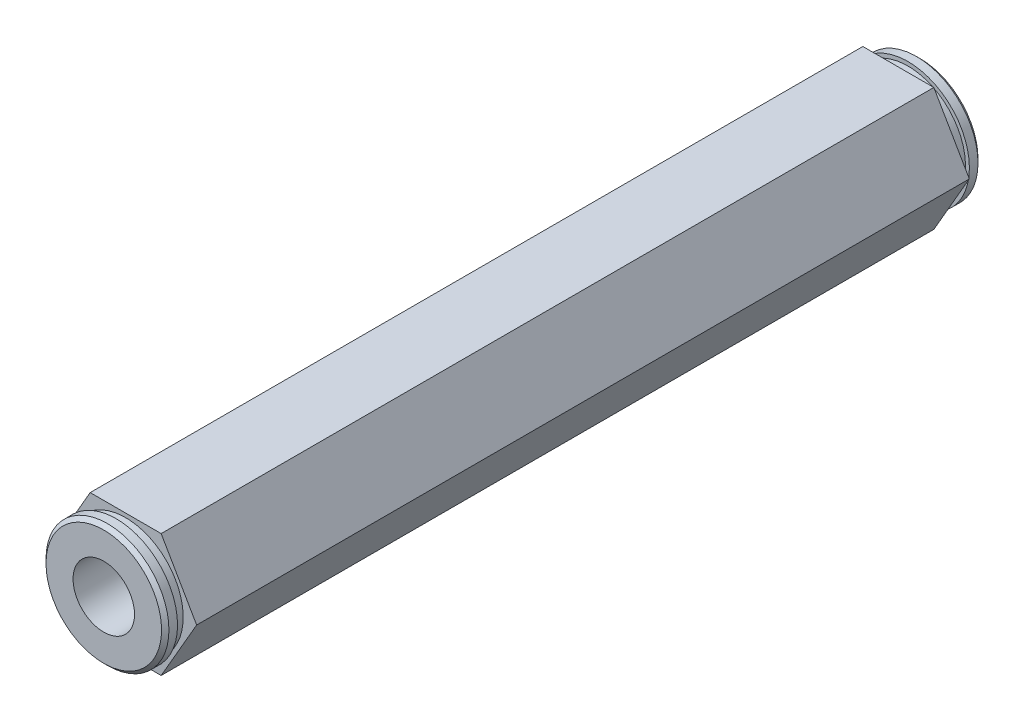
ISO-10303-21;
HEADER;
FILE_DESCRIPTION(('STEP AP214'),'2;1');
FILE_NAME('part.step','',(''),(''),'','','');
FILE_SCHEMA(('AUTOMOTIVE_DESIGN { 1 0 10303 214 1 1 1 1 }'));
ENDSEC;
DATA;
#1=APPLICATION_CONTEXT('core data for automotive mechanical design processes');
#2=APPLICATION_PROTOCOL_DEFINITION('international standard','automotive_design',2000,#1);
#3=PRODUCT_CONTEXT('',#1,'mechanical');
#4=PRODUCT('Part','Part','',(#3));
#5=PRODUCT_RELATED_PRODUCT_CATEGORY('part','',(#4));
#6=PRODUCT_DEFINITION_FORMATION('','',#4);
#7=PRODUCT_DEFINITION_CONTEXT('part definition',#1,'design');
#8=PRODUCT_DEFINITION('design','',#6,#7);
#9=PRODUCT_DEFINITION_SHAPE('','',#8);
#10=(LENGTH_UNIT() NAMED_UNIT(*) SI_UNIT(.MILLI.,.METRE.));
#11=(NAMED_UNIT(*) PLANE_ANGLE_UNIT() SI_UNIT($,.RADIAN.));
#12=(NAMED_UNIT(*) SI_UNIT($,.STERADIAN.) SOLID_ANGLE_UNIT());
#13=UNCERTAINTY_MEASURE_WITH_UNIT(LENGTH_MEASURE(1.E-05),#10,'distance_accuracy_value','');
#14=(GEOMETRIC_REPRESENTATION_CONTEXT(3) GLOBAL_UNCERTAINTY_ASSIGNED_CONTEXT((#13)) GLOBAL_UNIT_ASSIGNED_CONTEXT((#10,
#11,#12)) REPRESENTATION_CONTEXT('',''));
#15=CARTESIAN_POINT('',(0.,0.,0.));
#16=DIRECTION('',(0.,0.,1.));
#17=DIRECTION('',(1.,0.,0.));
#18=AXIS2_PLACEMENT_3D('',#15,#16,#17);
#19=CARTESIAN_POINT('',(0.,0.,37.5157999999942));
#20=DIRECTION('',(0.,0.,1.));
#21=DIRECTION('',(1.,0.,0.));
#22=AXIS2_PLACEMENT_3D('',#19,#20,#21);
#23=CONICAL_SURFACE('',#22,2.98450000002504,1.0297442586837);
#24=CARTESIAN_POINT('',(0.,0.,35.72253148252));
#25=VERTEX_POINT('',#24);
#26=VERTEX_LOOP('',#25);
#27=FACE_BOUND('',#26,.T.);
#28=CARTESIAN_POINT('',(0.,0.,37.5158));
#29=DIRECTION('',(0.,0.,1.));
#30=DIRECTION('',(1.,0.,0.));
#31=AXIS2_PLACEMENT_3D('',#28,#29,#30);
#32=CIRCLE('',#31,2.9845);
#33=CARTESIAN_POINT('',(2.9845,0.,37.5158));
#34=VERTEX_POINT('',#33);
#35=EDGE_CURVE('E78',#34,#34,#32,.T.);
#36=ORIENTED_EDGE('',*,*,#35,.T.);
#37=EDGE_LOOP('',(#36));
#38=FACE_BOUND('',#37,.T.);
#39=ADVANCED_FACE('F17',(#27,#38),#23,.F.);
#40=CARTESIAN_POINT('',(0.,0.,42.2783));
#41=DIRECTION('',(0.,0.,1.));
#42=DIRECTION('',(1.,0.,0.));
#43=AXIS2_PLACEMENT_3D('',#40,#41,#42);
#44=CYLINDRICAL_SURFACE('',#43,2.9845);
#45=ORIENTED_EDGE('',*,*,#35,.F.);
#46=EDGE_LOOP('',(#45));
#47=FACE_BOUND('',#46,.T.);
#48=CARTESIAN_POINT('',(0.,0.,39.1033));
#49=DIRECTION('',(0.,0.,1.));
#50=DIRECTION('',(1.,0.,0.));
#51=AXIS2_PLACEMENT_3D('',#48,#49,#50);
#52=CIRCLE('',#51,2.9845);
#53=CARTESIAN_POINT('',(2.9845,0.,39.1033));
#54=VERTEX_POINT('',#53);
#55=EDGE_CURVE('E20',#54,#54,#52,.F.);
#56=ORIENTED_EDGE('',*,*,#55,.F.);
#57=EDGE_LOOP('',(#56));
#58=FACE_BOUND('',#57,.T.);
#59=ADVANCED_FACE('F75',(#47,#58),#44,.F.);
#60=CARTESIAN_POINT('',(0.,0.,39.1033));
#61=DIRECTION('',(0.,0.,1.));
#62=DIRECTION('',(1.,0.,0.));
#63=AXIS2_PLACEMENT_3D('',#60,#61,#62);
#64=PLANE('',#63);
#65=CARTESIAN_POINT('',(0.,0.,39.1033));
#66=DIRECTION('',(0.,0.,1.));
#67=DIRECTION('',(1.,0.,0.));
#68=AXIS2_PLACEMENT_3D('',#65,#66,#67);
#69=CIRCLE('',#68,3.175);
#70=CARTESIAN_POINT('',(3.175,0.,39.1033));
#71=VERTEX_POINT('',#70);
#72=EDGE_CURVE('E82',#71,#71,#69,.T.);
#73=ORIENTED_EDGE('',*,*,#72,.T.);
#74=EDGE_LOOP('',(#73));
#75=FACE_BOUND('',#74,.T.);
#76=ORIENTED_EDGE('',*,*,#55,.T.);
#77=EDGE_LOOP('',(#76));
#78=FACE_BOUND('',#77,.T.);
#79=ADVANCED_FACE('F125',(#75,#78),#64,.T.);
#80=CARTESIAN_POINT('',(0.,0.,43.07205));
#81=DIRECTION('',(0.,0.,1.));
#82=DIRECTION('',(1.,0.,0.));
#83=AXIS2_PLACEMENT_3D('',#80,#81,#82);
#84=CYLINDRICAL_SURFACE('',#83,3.175);
#85=ORIENTED_EDGE('',*,*,#72,.F.);
#86=EDGE_LOOP('',(#85));
#87=FACE_BOUND('',#86,.T.);
#88=CARTESIAN_POINT('',(0.,0.,47.0408));
#89=DIRECTION('',(0.,0.,1.));
#90=DIRECTION('',(1.,0.,0.));
#91=AXIS2_PLACEMENT_3D('',#88,#89,#90);
#92=CIRCLE('',#91,3.175);
#93=CARTESIAN_POINT('',(3.175,0.,47.0408));
#94=VERTEX_POINT('',#93);
#95=EDGE_CURVE('E120',#94,#94,#92,.T.);
#96=ORIENTED_EDGE('',*,*,#95,.T.);
#97=EDGE_LOOP('',(#96));
#98=FACE_BOUND('',#97,.T.);
#99=ADVANCED_FACE('F128',(#87,#98),#84,.F.);
#100=CARTESIAN_POINT('',(0.,0.,-37.2999));
#101=DIRECTION('',(0.,0.,1.));
#102=DIRECTION('',(1.,0.,0.));
#103=AXIS2_PLACEMENT_3D('',#100,#101,#102);
#104=PLANE('',#103);
#105=CARTESIAN_POINT('',(0.,0.,-37.2999000000505));
#106=DIRECTION('',(0.,0.,1.));
#107=DIRECTION('',(1.,0.,0.));
#108=AXIS2_PLACEMENT_3D('',#105,#106,#107);
#109=CIRCLE('',#108,5.96899999993639);
#110=CARTESIAN_POINT('',(5.96899999993639,0.,-37.2999000000505));
#111=VERTEX_POINT('',#110);
#112=EDGE_CURVE('E117',#111,#111,#109,.T.);
#113=ORIENTED_EDGE('',*,*,#112,.F.);
#114=EDGE_LOOP('',(#113));
#115=FACE_BOUND('',#114,.T.);
#116=ADVANCED_FACE('F131',(#115),#104,.F.);
#117=CARTESIAN_POINT('',(0.,0.,47.0408));
#118=DIRECTION('',(0.,0.,-1.));
#119=DIRECTION('',(-1.,0.,0.));
#120=AXIS2_PLACEMENT_3D('',#117,#118,#119);
#121=PLANE('',#120);
#122=CARTESIAN_POINT('',(0.,0.,47.0408000000475));
#123=DIRECTION('',(0.,0.,-1.));
#124=DIRECTION('',(-1.,0.,0.));
#125=AXIS2_PLACEMENT_3D('',#122,#123,#124);
#126=CIRCLE('',#125,5.96899999993639);
#127=CARTESIAN_POINT('',(-5.96899999993639,0.,47.0408000000475));
#128=VERTEX_POINT('',#127);
#129=EDGE_CURVE('E113',#128,#128,#126,.T.);
#130=ORIENTED_EDGE('',*,*,#129,.F.);
#131=EDGE_LOOP('',(#130));
#132=FACE_BOUND('',#131,.T.);
#133=ORIENTED_EDGE('',*,*,#95,.F.);
#134=EDGE_LOOP('',(#133));
#135=FACE_BOUND('',#134,.T.);
#136=ADVANCED_FACE('F135',(#132,#135),#121,.F.);
#137=CARTESIAN_POINT('',(0.,0.,-36.9189000000461));
#138=DIRECTION('',(0.,0.,1.));
#139=DIRECTION('',(1.,0.,0.));
#140=AXIS2_PLACEMENT_3D('',#137,#138,#139);
#141=CONICAL_SURFACE('',#140,6.34999999994079,0.785398163397448);
#142=ORIENTED_EDGE('',*,*,#112,.T.);
#143=EDGE_LOOP('',(#142));
#144=FACE_BOUND('',#143,.T.);
#145=CARTESIAN_POINT('',(0.,0.,-36.9189));
#146=DIRECTION('',(0.,0.,1.));
#147=DIRECTION('',(1.,0.,0.));
#148=AXIS2_PLACEMENT_3D('',#145,#146,#147);
#149=CIRCLE('',#148,6.35);
#150=CARTESIAN_POINT('',(6.35,0.,-36.9189));
#151=VERTEX_POINT('',#150);
#152=EDGE_CURVE('E116',#151,#151,#149,.T.);
#153=ORIENTED_EDGE('',*,*,#152,.F.);
#154=EDGE_LOOP('',(#153));
#155=FACE_BOUND('',#154,.T.);
#156=ADVANCED_FACE('F137',(#144,#155),#141,.T.);
#157=CARTESIAN_POINT('',(0.,0.,46.6598000000431));
#158=DIRECTION('',(0.,0.,-1.));
#159=DIRECTION('',(-1.,0.,0.));
#160=AXIS2_PLACEMENT_3D('',#157,#158,#159);
#161=CONICAL_SURFACE('',#160,6.34999999994079,0.785398163397448);
#162=CARTESIAN_POINT('',(0.,0.,46.6598));
#163=DIRECTION('',(0.,0.,1.));
#164=DIRECTION('',(1.,0.,0.));
#165=AXIS2_PLACEMENT_3D('',#162,#163,#164);
#166=CIRCLE('',#165,6.35);
#167=CARTESIAN_POINT('',(6.35,0.,46.6598));
#168=VERTEX_POINT('',#167);
#169=EDGE_CURVE('E112',#168,#168,#166,.F.);
#170=ORIENTED_EDGE('',*,*,#169,.F.);
#171=EDGE_LOOP('',(#170));
#172=FACE_BOUND('',#171,.T.);
#173=ORIENTED_EDGE('',*,*,#129,.T.);
#174=EDGE_LOOP('',(#173));
#175=FACE_BOUND('',#174,.T.);
#176=ADVANCED_FACE('F145',(#172,#175),#161,.T.);
#177=CARTESIAN_POINT('',(0.,0.,-37.2999));
#178=DIRECTION('',(0.,0.,1.));
#179=DIRECTION('',(1.,0.,0.));
#180=AXIS2_PLACEMENT_3D('',#177,#178,#179);
#181=CYLINDRICAL_SURFACE('',#180,6.35);
#182=ORIENTED_EDGE('',*,*,#152,.T.);
#183=EDGE_LOOP('',(#182));
#184=FACE_BOUND('',#183,.T.);
#185=CARTESIAN_POINT('',(0.,0.,-36.0299));
#186=DIRECTION('',(0.,0.,1.));
#187=DIRECTION('',(1.,0.,0.));
#188=AXIS2_PLACEMENT_3D('',#185,#186,#187);
#189=CIRCLE('',#188,6.35);
#190=CARTESIAN_POINT('',(6.35,0.,-36.0299));
#191=VERTEX_POINT('',#190);
#192=EDGE_CURVE('E109',#191,#191,#189,.F.);
#193=ORIENTED_EDGE('',*,*,#192,.T.);
#194=EDGE_LOOP('',(#193));
#195=FACE_BOUND('',#194,.T.);
#196=ADVANCED_FACE('F205',(#184,#195),#181,.T.);
#197=CARTESIAN_POINT('',(0.,0.,0.));
#198=DIRECTION('',(0.,0.,1.));
#199=DIRECTION('',(1.,0.,0.));
#200=AXIS2_PLACEMENT_3D('',#197,#198,#199);
#201=CYLINDRICAL_SURFACE('',#200,6.35);
#202=ORIENTED_EDGE('',*,*,#169,.T.);
#203=EDGE_LOOP('',(#202));
#204=FACE_BOUND('',#203,.T.);
#205=CARTESIAN_POINT('',(0.,0.,45.7708));
#206=DIRECTION('',(0.,0.,1.));
#207=DIRECTION('',(1.,0.,0.));
#208=AXIS2_PLACEMENT_3D('',#205,#206,#207);
#209=CIRCLE('',#208,6.35);
#210=CARTESIAN_POINT('',(6.35,0.,45.7708));
#211=VERTEX_POINT('',#210);
#212=EDGE_CURVE('E106',#211,#211,#209,.T.);
#213=ORIENTED_EDGE('',*,*,#212,.T.);
#214=EDGE_LOOP('',(#213));
#215=FACE_BOUND('',#214,.T.);
#216=ADVANCED_FACE('F201',(#204,#215),#201,.T.);
#217=CARTESIAN_POINT('',(0.,7.49836623834794,-36.0299));
#218=DIRECTION('',(0.,0.,-1.));
#219=DIRECTION('',(0.,1.,0.));
#220=AXIS2_PLACEMENT_3D('',#217,#218,#219);
#221=PLANE('',#220);
#222=CARTESIAN_POINT('',(0.,0.,-36.0299));
#223=DIRECTION('',(0.,0.,1.));
#224=DIRECTION('',(0.,-1.,0.));
#225=AXIS2_PLACEMENT_3D('',#222,#223,#224);
#226=CIRCLE('',#225,5.9436);
#227=CARTESIAN_POINT('',(0.,-5.94359999999998,-36.0299));
#228=VERTEX_POINT('',#227);
#229=EDGE_CURVE('E103',#228,#228,#226,.T.);
#230=ORIENTED_EDGE('',*,*,#229,.F.);
#231=EDGE_LOOP('',(#230));
#232=FACE_BOUND('',#231,.T.);
#233=ORIENTED_EDGE('',*,*,#192,.F.);
#234=EDGE_LOOP('',(#233));
#235=FACE_BOUND('',#234,.T.);
#236=ADVANCED_FACE('F197',(#232,#235),#221,.F.);
#237=CARTESIAN_POINT('',(0.,6.51362770001113,45.7708));
#238=DIRECTION('',(0.,0.,1.));
#239=DIRECTION('',(0.,-1.,0.));
#240=AXIS2_PLACEMENT_3D('',#237,#238,#239);
#241=PLANE('',#240);
#242=CARTESIAN_POINT('',(0.,0.,45.7708));
#243=DIRECTION('',(0.,0.,1.));
#244=DIRECTION('',(0.,-1.,0.));
#245=AXIS2_PLACEMENT_3D('',#242,#243,#244);
#246=CIRCLE('',#245,5.9436);
#247=CARTESIAN_POINT('',(0.,-5.9436,45.7708));
#248=VERTEX_POINT('',#247);
#249=EDGE_CURVE('E99',#248,#248,#246,.F.);
#250=ORIENTED_EDGE('',*,*,#249,.F.);
#251=EDGE_LOOP('',(#250));
#252=FACE_BOUND('',#251,.T.);
#253=ORIENTED_EDGE('',*,*,#212,.F.);
#254=EDGE_LOOP('',(#253));
#255=FACE_BOUND('',#254,.T.);
#256=ADVANCED_FACE('F193',(#252,#255),#241,.F.);
#257=CARTESIAN_POINT('',(0.,0.,-35.5346));
#258=DIRECTION('',(0.,0.,1.));
#259=DIRECTION('',(0.,-1.,0.));
#260=AXIS2_PLACEMENT_3D('',#257,#258,#259);
#261=CYLINDRICAL_SURFACE('',#260,5.9436);
#262=CARTESIAN_POINT('',(0.,0.,-35.0393));
#263=DIRECTION('',(0.,0.,1.));
#264=DIRECTION('',(0.,-1.,0.));
#265=AXIS2_PLACEMENT_3D('',#262,#263,#264);
#266=CIRCLE('',#265,5.9436);
#267=CARTESIAN_POINT('',(0.,-5.94359999999999,-35.0393));
#268=VERTEX_POINT('',#267);
#269=EDGE_CURVE('E94',#268,#268,#266,.F.);
#270=ORIENTED_EDGE('',*,*,#269,.T.);
#271=EDGE_LOOP('',(#270));
#272=FACE_BOUND('',#271,.T.);
#273=ORIENTED_EDGE('',*,*,#229,.T.);
#274=EDGE_LOOP('',(#273));
#275=FACE_BOUND('',#274,.T.);
#276=ADVANCED_FACE('F190',(#272,#275),#261,.T.);
#277=CARTESIAN_POINT('',(3.66617420935411,-6.35,0.));
#278=DIRECTION('',(0.866025403784438,-0.5,0.));
#279=DIRECTION('',(0.5,0.866025403784438,0.));
#280=AXIS2_PLACEMENT_3D('',#277,#278,#279);
#281=PLANE('',#280);
#282=DIRECTION('',(-0.500000000000002,-0.866025403784438,0.));
#283=VECTOR('',#282,1.);
#284=CARTESIAN_POINT('',(7.33234841870825,0.,44.7802));
#285=LINE('',#284,#283);
#286=CARTESIAN_POINT('',(7.33234841870825,0.,44.7802));
#287=VERTEX_POINT('',#286);
#288=CARTESIAN_POINT('',(3.66617420935411,-6.35,44.7802));
#289=VERTEX_POINT('',#288);
#290=EDGE_CURVE('E238',#287,#289,#285,.T.);
#291=ORIENTED_EDGE('',*,*,#290,.T.);
#292=DIRECTION('',(0.,0.,1.));
#293=VECTOR('',#292,1.);
#294=CARTESIAN_POINT('',(3.66617420935411,-6.35,0.));
#295=LINE('',#294,#293);
#296=CARTESIAN_POINT('',(3.66617420935411,-6.35,-35.0393));
#297=VERTEX_POINT('',#296);
#298=EDGE_CURVE('E69',#297,#289,#295,.T.);
#299=ORIENTED_EDGE('',*,*,#298,.F.);
#300=DIRECTION('',(0.500000000000002,0.866025403784438,0.));
#301=VECTOR('',#300,1.);
#302=CARTESIAN_POINT('',(3.66617420935411,-6.35,-35.0393));
#303=LINE('',#302,#301);
#304=CARTESIAN_POINT('',(7.33234841870824,0.,-35.0393));
#305=VERTEX_POINT('',#304);
#306=EDGE_CURVE('E227',#297,#305,#303,.T.);
#307=ORIENTED_EDGE('',*,*,#306,.T.);
#308=DIRECTION('',(0.,0.,1.));
#309=VECTOR('',#308,1.);
#310=CARTESIAN_POINT('',(7.33234841870825,0.,0.));
#311=LINE('',#310,#309);
#312=EDGE_CURVE('E102',#287,#305,#311,.F.);
#313=ORIENTED_EDGE('',*,*,#312,.F.);
#314=EDGE_LOOP('',(#291,#299,#307,#313));
#315=FACE_BOUND('',#314,.T.);
#316=ADVANCED_FACE('F186',(#315),#281,.T.);
#317=CARTESIAN_POINT('',(-3.66617420935414,-6.35,0.));
#318=DIRECTION('',(0.,-1.,0.));
#319=DIRECTION('',(1.,0.,0.));
#320=AXIS2_PLACEMENT_3D('',#317,#318,#319);
#321=PLANE('',#320);
#322=DIRECTION('',(1.,0.,0.));
#323=VECTOR('',#322,1.);
#324=CARTESIAN_POINT('',(0.,-6.35,44.7802));
#325=LINE('',#324,#323);
#326=CARTESIAN_POINT('',(-3.66617420935414,-6.35,44.7802));
#327=VERTEX_POINT('',#326);
#328=EDGE_CURVE('E240',#289,#327,#325,.F.);
#329=ORIENTED_EDGE('',*,*,#328,.T.);
#330=DIRECTION('',(0.,0.,1.));
#331=VECTOR('',#330,1.);
#332=CARTESIAN_POINT('',(-3.66617420935413,-6.35,0.));
#333=LINE('',#332,#331);
#334=CARTESIAN_POINT('',(-3.66617420935414,-6.35,-35.0393));
#335=VERTEX_POINT('',#334);
#336=EDGE_CURVE('E232',#335,#327,#333,.T.);
#337=ORIENTED_EDGE('',*,*,#336,.F.);
#338=DIRECTION('',(1.,0.,0.));
#339=VECTOR('',#338,1.);
#340=CARTESIAN_POINT('',(0.,-6.35,-35.0393));
#341=LINE('',#340,#339);
#342=EDGE_CURVE('E225',#335,#297,#341,.T.);
#343=ORIENTED_EDGE('',*,*,#342,.T.);
#344=ORIENTED_EDGE('',*,*,#298,.T.);
#345=EDGE_LOOP('',(#329,#337,#343,#344));
#346=FACE_BOUND('',#345,.T.);
#347=ADVANCED_FACE('F182',(#346),#321,.T.);
#348=CARTESIAN_POINT('',(0.,0.,45.2755));
#349=DIRECTION('',(0.,0.,1.));
#350=DIRECTION('',(0.,-1.,0.));
#351=AXIS2_PLACEMENT_3D('',#348,#349,#350);
#352=CYLINDRICAL_SURFACE('',#351,5.9436);
#353=ORIENTED_EDGE('',*,*,#249,.T.);
#354=EDGE_LOOP('',(#353));
#355=FACE_BOUND('',#354,.T.);
#356=CARTESIAN_POINT('',(0.,0.,44.7802));
#357=DIRECTION('',(0.,0.,1.));
#358=DIRECTION('',(0.,-1.,0.));
#359=AXIS2_PLACEMENT_3D('',#356,#357,#358);
#360=CIRCLE('',#359,5.9436);
#361=CARTESIAN_POINT('',(0.,-5.9436,44.7802));
#362=VERTEX_POINT('',#361);
#363=EDGE_CURVE('E89',#362,#362,#360,.T.);
#364=ORIENTED_EDGE('',*,*,#363,.T.);
#365=EDGE_LOOP('',(#364));
#366=FACE_BOUND('',#365,.T.);
#367=ADVANCED_FACE('F178',(#355,#366),#352,.T.);
#368=CARTESIAN_POINT('',(7.33234841870825,0.,0.));
#369=DIRECTION('',(0.866025403784439,0.499999999999999,0.));
#370=DIRECTION('',(-0.499999999999999,0.866025403784439,0.));
#371=AXIS2_PLACEMENT_3D('',#368,#369,#370);
#372=PLANE('',#371);
#373=DIRECTION('',(0.499999999999999,-0.86602540378444,0.));
#374=VECTOR('',#373,1.);
#375=CARTESIAN_POINT('',(3.66617420935414,6.35,44.7802));
#376=LINE('',#375,#374);
#377=CARTESIAN_POINT('',(3.66617420935414,6.35,44.7802));
#378=VERTEX_POINT('',#377);
#379=EDGE_CURVE('E235',#378,#287,#376,.T.);
#380=ORIENTED_EDGE('',*,*,#379,.T.);
#381=ORIENTED_EDGE('',*,*,#312,.T.);
#382=DIRECTION('',(-0.499999999999999,0.86602540378444,0.));
#383=VECTOR('',#382,1.);
#384=CARTESIAN_POINT('',(7.33234841870825,0.,-35.0393));
#385=LINE('',#384,#383);
#386=CARTESIAN_POINT('',(3.66617420935414,6.35,-35.0393));
#387=VERTEX_POINT('',#386);
#388=EDGE_CURVE('E98',#305,#387,#385,.T.);
#389=ORIENTED_EDGE('',*,*,#388,.T.);
#390=DIRECTION('',(0.,0.,1.));
#391=VECTOR('',#390,1.);
#392=CARTESIAN_POINT('',(3.66617420935414,6.35,0.));
#393=LINE('',#392,#391);
#394=EDGE_CURVE('E246',#378,#387,#393,.F.);
#395=ORIENTED_EDGE('',*,*,#394,.F.);
#396=EDGE_LOOP('',(#380,#381,#389,#395));
#397=FACE_BOUND('',#396,.T.);
#398=ADVANCED_FACE('F174',(#397),#372,.T.);
#399=CARTESIAN_POINT('',(0.,7.49836623834794,-35.0393));
#400=DIRECTION('',(0.,0.,1.));
#401=DIRECTION('',(0.,-1.,0.));
#402=AXIS2_PLACEMENT_3D('',#399,#400,#401);
#403=PLANE('',#402);
#404=ORIENTED_EDGE('',*,*,#269,.F.);
#405=EDGE_LOOP('',(#404));
#406=FACE_BOUND('',#405,.T.);
#407=DIRECTION('',(-1.,0.,0.));
#408=VECTOR('',#407,1.);
#409=CARTESIAN_POINT('',(0.,6.35,-35.0393));
#410=LINE('',#409,#408);
#411=CARTESIAN_POINT('',(-3.66617420935411,6.35,-35.0393));
#412=VERTEX_POINT('',#411);
#413=EDGE_CURVE('E92',#387,#412,#410,.T.);
#414=ORIENTED_EDGE('',*,*,#413,.F.);
#415=ORIENTED_EDGE('',*,*,#388,.F.);
#416=ORIENTED_EDGE('',*,*,#306,.F.);
#417=ORIENTED_EDGE('',*,*,#342,.F.);
#418=DIRECTION('',(0.5,-0.866025403784439,0.));
#419=VECTOR('',#418,1.);
#420=CARTESIAN_POINT('',(-7.33234841870825,0.,-35.0393));
#421=LINE('',#420,#419);
#422=CARTESIAN_POINT('',(-7.33234841870825,0.,-35.0393));
#423=VERTEX_POINT('',#422);
#424=EDGE_CURVE('E97',#423,#335,#421,.T.);
#425=ORIENTED_EDGE('',*,*,#424,.F.);
#426=DIRECTION('',(-0.5,-0.866025403784439,0.));
#427=VECTOR('',#426,1.);
#428=CARTESIAN_POINT('',(-3.66617420935411,6.35,-35.0393));
#429=LINE('',#428,#427);
#430=EDGE_CURVE('E249',#412,#423,#429,.T.);
#431=ORIENTED_EDGE('',*,*,#430,.F.);
#432=EDGE_LOOP('',(#414,#415,#416,#417,#425,#431));
#433=FACE_BOUND('',#432,.T.);
#434=ADVANCED_FACE('F170',(#406,#433),#403,.F.);
#435=CARTESIAN_POINT('',(-7.33234841870825,0.,0.));
#436=DIRECTION('',(-0.866025403784439,-0.5,0.));
#437=DIRECTION('',(0.5,-0.866025403784439,0.));
#438=AXIS2_PLACEMENT_3D('',#435,#436,#437);
#439=PLANE('',#438);
#440=DIRECTION('',(-0.499999999999999,0.866025403784439,0.));
#441=VECTOR('',#440,1.);
#442=CARTESIAN_POINT('',(-3.66617420935414,-6.35,44.7802));
#443=LINE('',#442,#441);
#444=CARTESIAN_POINT('',(-7.33234841870825,0.,44.7802));
#445=VERTEX_POINT('',#444);
#446=EDGE_CURVE('E93',#327,#445,#443,.T.);
#447=ORIENTED_EDGE('',*,*,#446,.T.);
#448=DIRECTION('',(0.,0.,1.));
#449=VECTOR('',#448,1.);
#450=CARTESIAN_POINT('',(-7.33234841870824,0.,0.));
#451=LINE('',#450,#449);
#452=EDGE_CURVE('E252',#423,#445,#451,.T.);
#453=ORIENTED_EDGE('',*,*,#452,.F.);
#454=ORIENTED_EDGE('',*,*,#424,.T.);
#455=ORIENTED_EDGE('',*,*,#336,.T.);
#456=EDGE_LOOP('',(#447,#453,#454,#455));
#457=FACE_BOUND('',#456,.T.);
#458=ADVANCED_FACE('F166',(#457),#439,.T.);
#459=CARTESIAN_POINT('',(0.,6.51362770001113,44.7802));
#460=DIRECTION('',(0.,0.,-1.));
#461=DIRECTION('',(0.,1.,0.));
#462=AXIS2_PLACEMENT_3D('',#459,#460,#461);
#463=PLANE('',#462);
#464=ORIENTED_EDGE('',*,*,#363,.F.);
#465=EDGE_LOOP('',(#464));
#466=FACE_BOUND('',#465,.T.);
#467=ORIENTED_EDGE('',*,*,#328,.F.);
#468=ORIENTED_EDGE('',*,*,#290,.F.);
#469=ORIENTED_EDGE('',*,*,#379,.F.);
#470=DIRECTION('',(-1.,0.,0.));
#471=VECTOR('',#470,1.);
#472=CARTESIAN_POINT('',(0.,6.35,44.7802));
#473=LINE('',#472,#471);
#474=CARTESIAN_POINT('',(-3.66617420935411,6.35,44.7802));
#475=VERTEX_POINT('',#474);
#476=EDGE_CURVE('E35',#475,#378,#473,.F.);
#477=ORIENTED_EDGE('',*,*,#476,.F.);
#478=DIRECTION('',(-0.5,-0.866025403784439,0.));
#479=VECTOR('',#478,1.);
#480=CARTESIAN_POINT('',(-3.66617420935411,6.35,44.7802));
#481=LINE('',#480,#479);
#482=EDGE_CURVE('E26',#445,#475,#481,.F.);
#483=ORIENTED_EDGE('',*,*,#482,.F.);
#484=ORIENTED_EDGE('',*,*,#446,.F.);
#485=EDGE_LOOP('',(#467,#468,#469,#477,#483,#484));
#486=FACE_BOUND('',#485,.T.);
#487=ADVANCED_FACE('F159',(#466,#486),#463,.F.);
#488=CARTESIAN_POINT('',(0.,6.35,0.));
#489=DIRECTION('',(0.,1.,0.));
#490=DIRECTION('',(-1.,0.,0.));
#491=AXIS2_PLACEMENT_3D('',#488,#489,#490);
#492=PLANE('',#491);
#493=ORIENTED_EDGE('',*,*,#476,.T.);
#494=ORIENTED_EDGE('',*,*,#394,.T.);
#495=ORIENTED_EDGE('',*,*,#413,.T.);
#496=DIRECTION('',(0.,0.,1.));
#497=VECTOR('',#496,1.);
#498=CARTESIAN_POINT('',(-3.66617420935411,6.35,0.));
#499=LINE('',#498,#497);
#500=EDGE_CURVE('E11',#475,#412,#499,.F.);
#501=ORIENTED_EDGE('',*,*,#500,.F.);
#502=EDGE_LOOP('',(#493,#494,#495,#501));
#503=FACE_BOUND('',#502,.T.);
#504=ADVANCED_FACE('F153',(#503),#492,.T.);
#505=CARTESIAN_POINT('',(-3.66617420935411,6.35,0.));
#506=DIRECTION('',(-0.866025403784439,0.5,0.));
#507=DIRECTION('',(-0.5,-0.866025403784439,0.));
#508=AXIS2_PLACEMENT_3D('',#505,#506,#507);
#509=PLANE('',#508);
#510=ORIENTED_EDGE('',*,*,#482,.T.);
#511=ORIENTED_EDGE('',*,*,#500,.T.);
#512=ORIENTED_EDGE('',*,*,#430,.T.);
#513=ORIENTED_EDGE('',*,*,#452,.T.);
#514=EDGE_LOOP('',(#510,#511,#512,#513));
#515=FACE_BOUND('',#514,.T.);
#516=ADVANCED_FACE('F151',(#515),#509,.T.);
#517=CLOSED_SHELL('',(#39,#59,#79,#99,#116,#136,#156,#176,#196,#216,#236,#256,#276,#316,#347,
#367,#398,#434,#458,#487,#504,#516));
#518=MANIFOLD_SOLID_BREP('B1',#517);
#519=ADVANCED_BREP_SHAPE_REPRESENTATION('',(#18,#518),#14);
#520=SHAPE_DEFINITION_REPRESENTATION(#9,#519);
ENDSEC;
END-ISO-10303-21;
